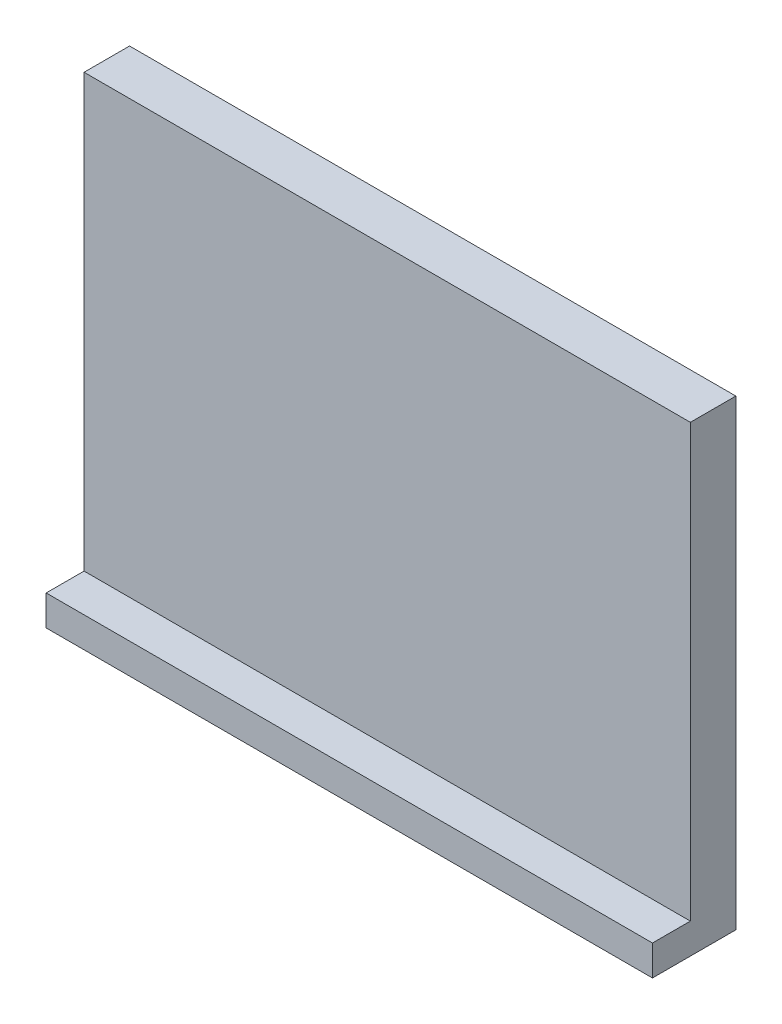
ISO-10303-21;
HEADER;
FILE_DESCRIPTION(('STEP AP214'),'2;1');
FILE_NAME('part.step','',(''),(''),'','','');
FILE_SCHEMA(('AUTOMOTIVE_DESIGN { 1 0 10303 214 1 1 1 1 }'));
ENDSEC;
DATA;
#1=APPLICATION_CONTEXT('core data for automotive mechanical design processes');
#2=APPLICATION_PROTOCOL_DEFINITION('international standard','automotive_design',2000,#1);
#3=PRODUCT_CONTEXT('',#1,'mechanical');
#4=PRODUCT('Part','Part','',(#3));
#5=PRODUCT_RELATED_PRODUCT_CATEGORY('part','',(#4));
#6=PRODUCT_DEFINITION_FORMATION('','',#4);
#7=PRODUCT_DEFINITION_CONTEXT('part definition',#1,'design');
#8=PRODUCT_DEFINITION('design','',#6,#7);
#9=PRODUCT_DEFINITION_SHAPE('','',#8);
#10=(LENGTH_UNIT() NAMED_UNIT(*) SI_UNIT(.MILLI.,.METRE.));
#11=(NAMED_UNIT(*) PLANE_ANGLE_UNIT() SI_UNIT($,.RADIAN.));
#12=(NAMED_UNIT(*) SI_UNIT($,.STERADIAN.) SOLID_ANGLE_UNIT());
#13=UNCERTAINTY_MEASURE_WITH_UNIT(LENGTH_MEASURE(1.E-05),#10,'distance_accuracy_value','');
#14=(GEOMETRIC_REPRESENTATION_CONTEXT(3) GLOBAL_UNCERTAINTY_ASSIGNED_CONTEXT((#13)) GLOBAL_UNIT_ASSIGNED_CONTEXT((#10,
#11,#12)) REPRESENTATION_CONTEXT('',''));
#15=CARTESIAN_POINT('',(0.,0.,0.));
#16=DIRECTION('',(0.,0.,1.));
#17=DIRECTION('',(1.,0.,0.));
#18=AXIS2_PLACEMENT_3D('',#15,#16,#17);
#19=CARTESIAN_POINT('',(0.,0.,6.));
#20=DIRECTION('',(0.,0.,-1.));
#21=DIRECTION('',(-1.,0.,0.));
#22=AXIS2_PLACEMENT_3D('',#19,#20,#21);
#23=PLANE('',#22);
#24=DIRECTION('',(-1.,0.,0.));
#25=VECTOR('',#24,1.);
#26=CARTESIAN_POINT('',(0.,4.,6.));
#27=LINE('',#26,#25);
#28=CARTESIAN_POINT('',(80.,4.,6.));
#29=VERTEX_POINT('',#28);
#30=CARTESIAN_POINT('',(0.,4.,6.));
#31=VERTEX_POINT('',#30);
#32=EDGE_CURVE('E47',#29,#31,#27,.T.);
#33=ORIENTED_EDGE('',*,*,#32,.F.);
#34=DIRECTION('',(0.,1.,0.));
#35=VECTOR('',#34,1.);
#36=CARTESIAN_POINT('',(80.,0.,6.));
#37=LINE('',#36,#35);
#38=CARTESIAN_POINT('',(80.,61.,6.));
#39=VERTEX_POINT('',#38);
#40=EDGE_CURVE('E134',#29,#39,#37,.T.);
#41=ORIENTED_EDGE('',*,*,#40,.T.);
#42=DIRECTION('',(-1.,0.,0.));
#43=VECTOR('',#42,1.);
#44=CARTESIAN_POINT('',(0.,61.,6.));
#45=LINE('',#44,#43);
#46=CARTESIAN_POINT('',(0.,61.,6.));
#47=VERTEX_POINT('',#46);
#48=EDGE_CURVE('E53',#39,#47,#45,.T.);
#49=ORIENTED_EDGE('',*,*,#48,.T.);
#50=DIRECTION('',(0.,-1.,0.));
#51=VECTOR('',#50,1.);
#52=CARTESIAN_POINT('',(0.,0.,6.));
#53=LINE('',#52,#51);
#54=EDGE_CURVE('E82',#47,#31,#53,.T.);
#55=ORIENTED_EDGE('',*,*,#54,.T.);
#56=EDGE_LOOP('',(#33,#41,#49,#55));
#57=FACE_BOUND('',#56,.T.);
#58=ADVANCED_FACE('F32',(#57),#23,.F.);
#59=CARTESIAN_POINT('',(0.,0.,6.));
#60=DIRECTION('',(1.,0.,0.));
#61=DIRECTION('',(0.,0.,-1.));
#62=AXIS2_PLACEMENT_3D('',#59,#60,#61);
#63=PLANE('',#62);
#64=DIRECTION('',(0.,-1.,0.));
#65=VECTOR('',#64,1.);
#66=CARTESIAN_POINT('',(0.,0.,0.));
#67=LINE('',#66,#65);
#68=CARTESIAN_POINT('',(0.,61.,0.));
#69=VERTEX_POINT('',#68);
#70=CARTESIAN_POINT('',(0.,0.,0.));
#71=VERTEX_POINT('',#70);
#72=EDGE_CURVE('E88',#69,#71,#67,.T.);
#73=ORIENTED_EDGE('',*,*,#72,.T.);
#74=DIRECTION('',(0.,0.,-1.));
#75=VECTOR('',#74,1.);
#76=CARTESIAN_POINT('',(0.,0.,6.));
#77=LINE('',#76,#75);
#78=CARTESIAN_POINT('',(0.,0.,11.));
#79=VERTEX_POINT('',#78);
#80=EDGE_CURVE('E11',#79,#71,#77,.T.);
#81=ORIENTED_EDGE('',*,*,#80,.F.);
#82=DIRECTION('',(0.,-1.,0.));
#83=VECTOR('',#82,1.);
#84=CARTESIAN_POINT('',(0.,0.,11.));
#85=LINE('',#84,#83);
#86=CARTESIAN_POINT('',(0.,4.,11.));
#87=VERTEX_POINT('',#86);
#88=EDGE_CURVE('E125',#87,#79,#85,.T.);
#89=ORIENTED_EDGE('',*,*,#88,.F.);
#90=DIRECTION('',(0.,0.,-1.));
#91=VECTOR('',#90,1.);
#92=CARTESIAN_POINT('',(0.,4.,11.));
#93=LINE('',#92,#91);
#94=EDGE_CURVE('E97',#87,#31,#93,.T.);
#95=ORIENTED_EDGE('',*,*,#94,.T.);
#96=ORIENTED_EDGE('',*,*,#54,.F.);
#97=DIRECTION('',(0.,0.,-1.));
#98=VECTOR('',#97,1.);
#99=CARTESIAN_POINT('',(0.,61.,6.));
#100=LINE('',#99,#98);
#101=EDGE_CURVE('E75',#47,#69,#100,.T.);
#102=ORIENTED_EDGE('',*,*,#101,.T.);
#103=EDGE_LOOP('',(#73,#81,#89,#95,#96,#102));
#104=FACE_BOUND('',#103,.T.);
#105=ADVANCED_FACE('F34',(#104),#63,.F.);
#106=CARTESIAN_POINT('',(0.,0.,6.));
#107=DIRECTION('',(0.,1.,0.));
#108=DIRECTION('',(0.,0.,1.));
#109=AXIS2_PLACEMENT_3D('',#106,#107,#108);
#110=PLANE('',#109);
#111=DIRECTION('',(1.,0.,0.));
#112=VECTOR('',#111,1.);
#113=CARTESIAN_POINT('',(0.,0.,0.));
#114=LINE('',#113,#112);
#115=CARTESIAN_POINT('',(80.,0.,0.));
#116=VERTEX_POINT('',#115);
#117=EDGE_CURVE('E92',#71,#116,#114,.T.);
#118=ORIENTED_EDGE('',*,*,#117,.T.);
#119=DIRECTION('',(0.,0.,-1.));
#120=VECTOR('',#119,1.);
#121=CARTESIAN_POINT('',(80.,0.,6.));
#122=LINE('',#121,#120);
#123=CARTESIAN_POINT('',(80.,0.,11.));
#124=VERTEX_POINT('',#123);
#125=EDGE_CURVE('E40',#124,#116,#122,.T.);
#126=ORIENTED_EDGE('',*,*,#125,.F.);
#127=DIRECTION('',(1.,0.,0.));
#128=VECTOR('',#127,1.);
#129=CARTESIAN_POINT('',(0.,0.,11.));
#130=LINE('',#129,#128);
#131=EDGE_CURVE('E117',#79,#124,#130,.T.);
#132=ORIENTED_EDGE('',*,*,#131,.F.);
#133=ORIENTED_EDGE('',*,*,#80,.T.);
#134=EDGE_LOOP('',(#118,#126,#132,#133));
#135=FACE_BOUND('',#134,.T.);
#136=ADVANCED_FACE('F115',(#135),#110,.F.);
#137=CARTESIAN_POINT('',(80.,0.,6.));
#138=DIRECTION('',(-1.,0.,0.));
#139=DIRECTION('',(0.,0.,1.));
#140=AXIS2_PLACEMENT_3D('',#137,#138,#139);
#141=PLANE('',#140);
#142=DIRECTION('',(0.,1.,0.));
#143=VECTOR('',#142,1.);
#144=CARTESIAN_POINT('',(80.,0.,0.));
#145=LINE('',#144,#143);
#146=CARTESIAN_POINT('',(80.,61.,0.));
#147=VERTEX_POINT('',#146);
#148=EDGE_CURVE('E83',#116,#147,#145,.T.);
#149=ORIENTED_EDGE('',*,*,#148,.T.);
#150=DIRECTION('',(0.,0.,-1.));
#151=VECTOR('',#150,1.);
#152=CARTESIAN_POINT('',(80.,61.,6.));
#153=LINE('',#152,#151);
#154=EDGE_CURVE('E78',#39,#147,#153,.T.);
#155=ORIENTED_EDGE('',*,*,#154,.F.);
#156=ORIENTED_EDGE('',*,*,#40,.F.);
#157=DIRECTION('',(0.,0.,-1.));
#158=VECTOR('',#157,1.);
#159=CARTESIAN_POINT('',(80.,4.,11.));
#160=LINE('',#159,#158);
#161=CARTESIAN_POINT('',(80.,4.,11.));
#162=VERTEX_POINT('',#161);
#163=EDGE_CURVE('E93',#162,#29,#160,.T.);
#164=ORIENTED_EDGE('',*,*,#163,.F.);
#165=DIRECTION('',(0.,1.,0.));
#166=VECTOR('',#165,1.);
#167=CARTESIAN_POINT('',(80.,0.,11.));
#168=LINE('',#167,#166);
#169=EDGE_CURVE('E111',#124,#162,#168,.T.);
#170=ORIENTED_EDGE('',*,*,#169,.F.);
#171=ORIENTED_EDGE('',*,*,#125,.T.);
#172=EDGE_LOOP('',(#149,#155,#156,#164,#170,#171));
#173=FACE_BOUND('',#172,.T.);
#174=ADVANCED_FACE('F107',(#173),#141,.F.);
#175=CARTESIAN_POINT('',(0.,61.,6.));
#176=DIRECTION('',(0.,-1.,0.));
#177=DIRECTION('',(0.,0.,-1.));
#178=AXIS2_PLACEMENT_3D('',#175,#176,#177);
#179=PLANE('',#178);
#180=DIRECTION('',(-1.,0.,0.));
#181=VECTOR('',#180,1.);
#182=CARTESIAN_POINT('',(0.,61.,0.));
#183=LINE('',#182,#181);
#184=EDGE_CURVE('E72',#147,#69,#183,.T.);
#185=ORIENTED_EDGE('',*,*,#184,.T.);
#186=ORIENTED_EDGE('',*,*,#101,.F.);
#187=ORIENTED_EDGE('',*,*,#48,.F.);
#188=ORIENTED_EDGE('',*,*,#154,.T.);
#189=EDGE_LOOP('',(#185,#186,#187,#188));
#190=FACE_BOUND('',#189,.T.);
#191=ADVANCED_FACE('F74',(#190),#179,.F.);
#192=CARTESIAN_POINT('',(0.,0.,0.));
#193=DIRECTION('',(0.,0.,-1.));
#194=DIRECTION('',(-1.,0.,0.));
#195=AXIS2_PLACEMENT_3D('',#192,#193,#194);
#196=PLANE('',#195);
#197=ORIENTED_EDGE('',*,*,#72,.F.);
#198=ORIENTED_EDGE('',*,*,#184,.F.);
#199=ORIENTED_EDGE('',*,*,#148,.F.);
#200=ORIENTED_EDGE('',*,*,#117,.F.);
#201=EDGE_LOOP('',(#197,#198,#199,#200));
#202=FACE_BOUND('',#201,.T.);
#203=ADVANCED_FACE('F91',(#202),#196,.T.);
#204=CARTESIAN_POINT('',(0.,4.,11.));
#205=DIRECTION('',(0.,-1.,0.));
#206=DIRECTION('',(0.,0.,-1.));
#207=AXIS2_PLACEMENT_3D('',#204,#205,#206);
#208=PLANE('',#207);
#209=ORIENTED_EDGE('',*,*,#32,.T.);
#210=ORIENTED_EDGE('',*,*,#94,.F.);
#211=DIRECTION('',(-1.,0.,0.));
#212=VECTOR('',#211,1.);
#213=CARTESIAN_POINT('',(0.,4.,11.));
#214=LINE('',#213,#212);
#215=EDGE_CURVE('E127',#162,#87,#214,.T.);
#216=ORIENTED_EDGE('',*,*,#215,.F.);
#217=ORIENTED_EDGE('',*,*,#163,.T.);
#218=EDGE_LOOP('',(#209,#210,#216,#217));
#219=FACE_BOUND('',#218,.T.);
#220=ADVANCED_FACE('F137',(#219),#208,.F.);
#221=CARTESIAN_POINT('',(0.,0.,11.));
#222=DIRECTION('',(0.,0.,-1.));
#223=DIRECTION('',(-1.,0.,0.));
#224=AXIS2_PLACEMENT_3D('',#221,#222,#223);
#225=PLANE('',#224);
#226=ORIENTED_EDGE('',*,*,#88,.T.);
#227=ORIENTED_EDGE('',*,*,#131,.T.);
#228=ORIENTED_EDGE('',*,*,#169,.T.);
#229=ORIENTED_EDGE('',*,*,#215,.T.);
#230=EDGE_LOOP('',(#226,#227,#228,#229));
#231=FACE_BOUND('',#230,.T.);
#232=ADVANCED_FACE('F122',(#231),#225,.F.);
#233=CLOSED_SHELL('',(#58,#105,#136,#174,#191,#203,#220,#232));
#234=MANIFOLD_SOLID_BREP('B2',#233);
#235=ADVANCED_BREP_SHAPE_REPRESENTATION('',(#18,#234),#14);
#236=SHAPE_DEFINITION_REPRESENTATION(#9,#235);
ENDSEC;
END-ISO-10303-21;
